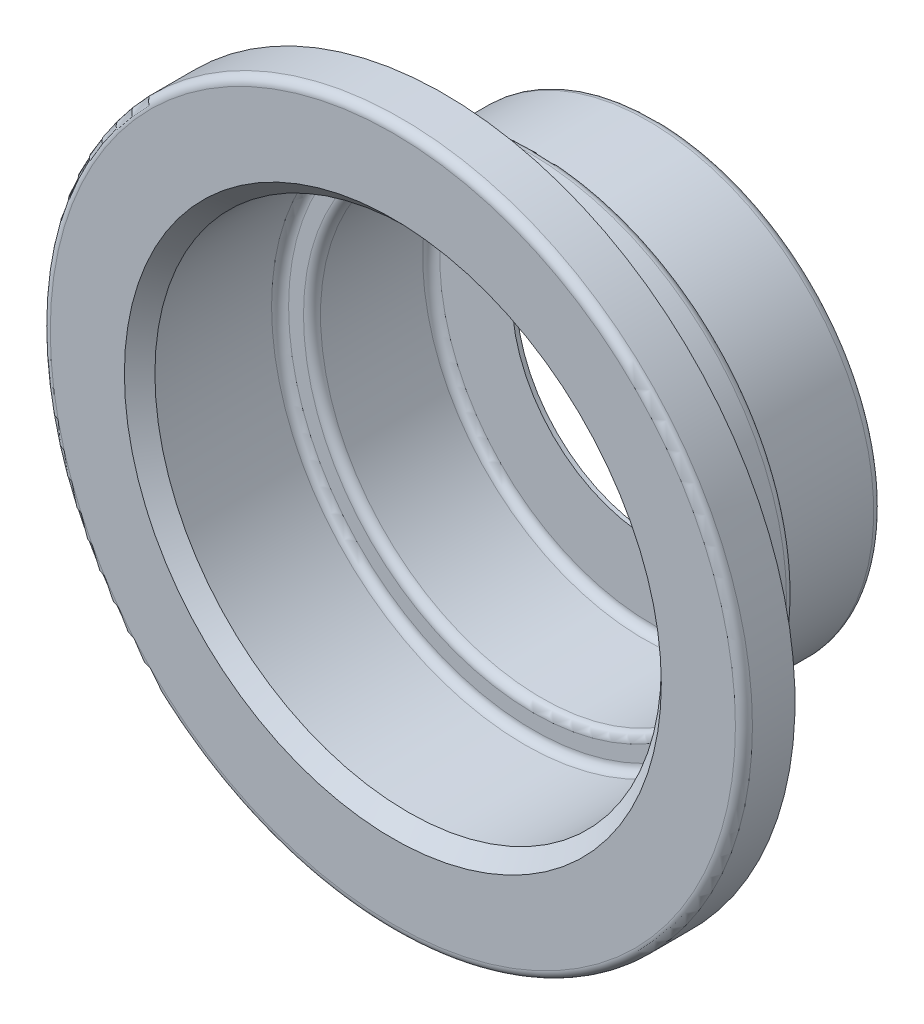
ISO-10303-21;
HEADER;
FILE_DESCRIPTION(('STEP AP214'),'2;1');
FILE_NAME('part.step','',(''),(''),'','','');
FILE_SCHEMA(('AUTOMOTIVE_DESIGN { 1 0 10303 214 1 1 1 1 }'));
ENDSEC;
DATA;
#1=APPLICATION_CONTEXT('core data for automotive mechanical design processes');
#2=APPLICATION_PROTOCOL_DEFINITION('international standard','automotive_design',2000,#1);
#3=PRODUCT_CONTEXT('',#1,'mechanical');
#4=PRODUCT('Part','Part','',(#3));
#5=PRODUCT_RELATED_PRODUCT_CATEGORY('part','',(#4));
#6=PRODUCT_DEFINITION_FORMATION('','',#4);
#7=PRODUCT_DEFINITION_CONTEXT('part definition',#1,'design');
#8=PRODUCT_DEFINITION('design','',#6,#7);
#9=PRODUCT_DEFINITION_SHAPE('','',#8);
#10=(LENGTH_UNIT() NAMED_UNIT(*) SI_UNIT(.MILLI.,.METRE.));
#11=(NAMED_UNIT(*) PLANE_ANGLE_UNIT() SI_UNIT($,.RADIAN.));
#12=(NAMED_UNIT(*) SI_UNIT($,.STERADIAN.) SOLID_ANGLE_UNIT());
#13=UNCERTAINTY_MEASURE_WITH_UNIT(LENGTH_MEASURE(1.E-05),#10,'distance_accuracy_value','');
#14=(GEOMETRIC_REPRESENTATION_CONTEXT(3) GLOBAL_UNCERTAINTY_ASSIGNED_CONTEXT((#13)) GLOBAL_UNIT_ASSIGNED_CONTEXT((#10,
#11,#12)) REPRESENTATION_CONTEXT('',''));
#15=CARTESIAN_POINT('',(0.,0.,0.));
#16=DIRECTION('',(0.,0.,1.));
#17=DIRECTION('',(1.,0.,0.));
#18=AXIS2_PLACEMENT_3D('',#15,#16,#17);
#19=CARTESIAN_POINT('',(0.,0.,0.));
#20=DIRECTION('',(0.,0.,-1.));
#21=DIRECTION('',(-1.,0.,0.));
#22=AXIS2_PLACEMENT_3D('',#19,#20,#21);
#23=PLANE('',#22);
#24=CARTESIAN_POINT('',(0.,0.,0.));
#25=DIRECTION('',(0.,0.,-1.));
#26=DIRECTION('',(-1.,0.,0.));
#27=AXIS2_PLACEMENT_3D('',#24,#25,#26);
#28=CIRCLE('',#27,12.954);
#29=CARTESIAN_POINT('',(-12.954,0.,0.));
#30=VERTEX_POINT('',#29);
#31=EDGE_CURVE('E76',#30,#30,#28,.T.);
#32=ORIENTED_EDGE('',*,*,#31,.T.);
#33=EDGE_LOOP('',(#32));
#34=FACE_BOUND('',#33,.T.);
#35=CARTESIAN_POINT('',(0.,0.,0.));
#36=DIRECTION('',(0.,0.,1.));
#37=DIRECTION('',(1.,0.,0.));
#38=AXIS2_PLACEMENT_3D('',#35,#36,#37);
#39=CIRCLE('',#38,8.382);
#40=CARTESIAN_POINT('',(8.382,0.,0.));
#41=VERTEX_POINT('',#40);
#42=EDGE_CURVE('E121',#41,#41,#39,.T.);
#43=ORIENTED_EDGE('',*,*,#42,.T.);
#44=EDGE_LOOP('',(#43));
#45=FACE_BOUND('',#44,.T.);
#46=ADVANCED_FACE('F50',(#34,#45),#23,.T.);
#47=CARTESIAN_POINT('',(0.,0.,0.));
#48=DIRECTION('',(0.,0.,-1.));
#49=DIRECTION('',(-1.,0.,0.));
#50=AXIS2_PLACEMENT_3D('',#47,#48,#49);
#51=CYLINDRICAL_SURFACE('',#50,13.462);
#52=CARTESIAN_POINT('',(0.,0.,6.604));
#53=DIRECTION('',(0.,0.,-1.));
#54=DIRECTION('',(-1.,0.,0.));
#55=AXIS2_PLACEMENT_3D('',#52,#53,#54);
#56=CIRCLE('',#55,13.462);
#57=CARTESIAN_POINT('',(-13.462,0.,6.604));
#58=VERTEX_POINT('',#57);
#59=EDGE_CURVE('E88',#58,#58,#56,.T.);
#60=ORIENTED_EDGE('',*,*,#59,.T.);
#61=EDGE_LOOP('',(#60));
#62=FACE_BOUND('',#61,.T.);
#63=CARTESIAN_POINT('',(0.,0.,0.508));
#64=DIRECTION('',(0.,0.,-1.));
#65=DIRECTION('',(-1.,0.,0.));
#66=AXIS2_PLACEMENT_3D('',#63,#64,#65);
#67=CIRCLE('',#66,13.462);
#68=CARTESIAN_POINT('',(-13.462,0.,0.508));
#69=VERTEX_POINT('',#68);
#70=EDGE_CURVE('E91',#69,#69,#67,.F.);
#71=ORIENTED_EDGE('',*,*,#70,.T.);
#72=EDGE_LOOP('',(#71));
#73=FACE_BOUND('',#72,.T.);
#74=ADVANCED_FACE('F148',(#62,#73),#51,.T.);
#75=CARTESIAN_POINT('',(0.,13.462,7.112));
#76=DIRECTION('',(0.,0.,-1.));
#77=DIRECTION('',(-1.,0.,0.));
#78=AXIS2_PLACEMENT_3D('',#75,#76,#77);
#79=PLANE('',#78);
#80=CARTESIAN_POINT('',(0.,0.,7.112));
#81=DIRECTION('',(0.,0.,-1.));
#82=DIRECTION('',(-1.,0.,0.));
#83=AXIS2_PLACEMENT_3D('',#80,#81,#82);
#84=CIRCLE('',#83,13.97);
#85=CARTESIAN_POINT('',(-13.97,0.,7.112));
#86=VERTEX_POINT('',#85);
#87=EDGE_CURVE('E82',#86,#86,#84,.F.);
#88=ORIENTED_EDGE('',*,*,#87,.T.);
#89=EDGE_LOOP('',(#88));
#90=FACE_BOUND('',#89,.T.);
#91=CARTESIAN_POINT('',(0.,0.,7.112));
#92=DIRECTION('',(0.,0.,-1.));
#93=DIRECTION('',(-1.,0.,0.));
#94=AXIS2_PLACEMENT_3D('',#91,#92,#93);
#95=CIRCLE('',#94,14.859);
#96=CARTESIAN_POINT('',(-14.859,0.,7.112));
#97=VERTEX_POINT('',#96);
#98=EDGE_CURVE('E85',#97,#97,#95,.T.);
#99=ORIENTED_EDGE('',*,*,#98,.T.);
#100=EDGE_LOOP('',(#99));
#101=FACE_BOUND('',#100,.T.);
#102=ADVANCED_FACE('F154',(#90,#101),#79,.T.);
#103=CARTESIAN_POINT('',(0.,0.,0.));
#104=DIRECTION('',(0.,0.,-1.));
#105=DIRECTION('',(-1.,0.,0.));
#106=AXIS2_PLACEMENT_3D('',#103,#104,#105);
#107=CYLINDRICAL_SURFACE('',#106,15.367);
#108=CARTESIAN_POINT('',(0.,0.,7.62));
#109=DIRECTION('',(0.,0.,-1.));
#110=DIRECTION('',(-1.,0.,0.));
#111=AXIS2_PLACEMENT_3D('',#108,#109,#110);
#112=CIRCLE('',#111,15.367);
#113=CARTESIAN_POINT('',(-15.367,0.,7.62));
#114=VERTEX_POINT('',#113);
#115=EDGE_CURVE('E79',#114,#114,#112,.F.);
#116=ORIENTED_EDGE('',*,*,#115,.T.);
#117=EDGE_LOOP('',(#116));
#118=FACE_BOUND('',#117,.T.);
#119=CARTESIAN_POINT('',(0.,0.,14.732));
#120=DIRECTION('',(0.,0.,-1.));
#121=DIRECTION('',(-1.,0.,0.));
#122=AXIS2_PLACEMENT_3D('',#119,#120,#121);
#123=CIRCLE('',#122,15.367);
#124=CARTESIAN_POINT('',(-15.367,0.,14.732));
#125=VERTEX_POINT('',#124);
#126=EDGE_CURVE('E100',#125,#125,#123,.T.);
#127=ORIENTED_EDGE('',*,*,#126,.T.);
#128=EDGE_LOOP('',(#127));
#129=FACE_BOUND('',#128,.T.);
#130=ADVANCED_FACE('F225',(#118,#129),#107,.T.);
#131=CARTESIAN_POINT('',(0.,0.,14.732));
#132=DIRECTION('',(0.,0.,1.));
#133=DIRECTION('',(1.,0.,0.));
#134=AXIS2_PLACEMENT_3D('',#131,#132,#133);
#135=CONICAL_SURFACE('',#134,15.367,0.78539816339745);
#136=CARTESIAN_POINT('',(0.,0.,15.494));
#137=DIRECTION('',(0.,0.,-1.));
#138=DIRECTION('',(-1.,0.,0.));
#139=AXIS2_PLACEMENT_3D('',#136,#137,#138);
#140=CIRCLE('',#139,16.129);
#141=CARTESIAN_POINT('',(-16.129,0.,15.494));
#142=VERTEX_POINT('',#141);
#143=EDGE_CURVE('E103',#142,#142,#140,.T.);
#144=ORIENTED_EDGE('',*,*,#143,.T.);
#145=EDGE_LOOP('',(#144));
#146=FACE_BOUND('',#145,.T.);
#147=ORIENTED_EDGE('',*,*,#126,.F.);
#148=EDGE_LOOP('',(#147));
#149=FACE_BOUND('',#148,.T.);
#150=ADVANCED_FACE('F221',(#146,#149),#135,.T.);
#151=CARTESIAN_POINT('',(0.,20.701,15.494));
#152=DIRECTION('',(0.,0.,-1.));
#153=DIRECTION('',(-1.,0.,0.));
#154=AXIS2_PLACEMENT_3D('',#151,#152,#153);
#155=PLANE('',#154);
#156=CARTESIAN_POINT('',(0.,0.,15.494));
#157=DIRECTION('',(0.,0.,-1.));
#158=DIRECTION('',(-1.,0.,0.));
#159=AXIS2_PLACEMENT_3D('',#156,#157,#158);
#160=CIRCLE('',#159,20.701);
#161=CARTESIAN_POINT('',(-20.701,0.,15.494));
#162=VERTEX_POINT('',#161);
#163=EDGE_CURVE('E106',#162,#162,#160,.T.);
#164=ORIENTED_EDGE('',*,*,#163,.T.);
#165=EDGE_LOOP('',(#164));
#166=FACE_BOUND('',#165,.T.);
#167=ORIENTED_EDGE('',*,*,#143,.F.);
#168=EDGE_LOOP('',(#167));
#169=FACE_BOUND('',#168,.T.);
#170=ADVANCED_FACE('F217',(#166,#169),#155,.T.);
#171=CARTESIAN_POINT('',(0.,0.,0.));
#172=DIRECTION('',(0.,0.,-1.));
#173=DIRECTION('',(-1.,0.,0.));
#174=AXIS2_PLACEMENT_3D('',#171,#172,#173);
#175=CYLINDRICAL_SURFACE('',#174,20.701);
#176=CARTESIAN_POINT('',(0.,0.,12.7));
#177=DIRECTION('',(0.,0.,-1.));
#178=DIRECTION('',(-1.,0.,0.));
#179=AXIS2_PLACEMENT_3D('',#176,#177,#178);
#180=CIRCLE('',#179,20.701);
#181=CARTESIAN_POINT('',(-20.701,0.,12.7));
#182=VERTEX_POINT('',#181);
#183=EDGE_CURVE('E109',#182,#182,#180,.T.);
#184=ORIENTED_EDGE('',*,*,#183,.T.);
#185=EDGE_LOOP('',(#184));
#186=FACE_BOUND('',#185,.T.);
#187=ORIENTED_EDGE('',*,*,#163,.F.);
#188=EDGE_LOOP('',(#187));
#189=FACE_BOUND('',#188,.T.);
#190=ADVANCED_FACE('F213',(#186,#189),#175,.F.);
#191=CARTESIAN_POINT('',(0.,20.955,12.7));
#192=DIRECTION('',(0.,0.,-1.));
#193=DIRECTION('',(-1.,0.,0.));
#194=AXIS2_PLACEMENT_3D('',#191,#192,#193);
#195=PLANE('',#194);
#196=CARTESIAN_POINT('',(0.,0.,12.7));
#197=DIRECTION('',(0.,0.,-1.));
#198=DIRECTION('',(-1.,0.,0.));
#199=AXIS2_PLACEMENT_3D('',#196,#197,#198);
#200=CIRCLE('',#199,20.955);
#201=CARTESIAN_POINT('',(-20.955,0.,12.7));
#202=VERTEX_POINT('',#201);
#203=EDGE_CURVE('E112',#202,#202,#200,.T.);
#204=ORIENTED_EDGE('',*,*,#203,.T.);
#205=EDGE_LOOP('',(#204));
#206=FACE_BOUND('',#205,.T.);
#207=ORIENTED_EDGE('',*,*,#183,.F.);
#208=EDGE_LOOP('',(#207));
#209=FACE_BOUND('',#208,.T.);
#210=ADVANCED_FACE('F207',(#206,#209),#195,.T.);
#211=CARTESIAN_POINT('',(0.,0.,0.));
#212=DIRECTION('',(0.,0.,-1.));
#213=DIRECTION('',(-1.,0.,0.));
#214=AXIS2_PLACEMENT_3D('',#211,#212,#213);
#215=CYLINDRICAL_SURFACE('',#214,20.955);
#216=CARTESIAN_POINT('',(0.,0.,15.24));
#217=DIRECTION('',(0.,0.,1.));
#218=DIRECTION('',(1.,0.,0.));
#219=AXIS2_PLACEMENT_3D('',#216,#217,#218);
#220=CIRCLE('',#219,20.955);
#221=CARTESIAN_POINT('',(20.955,0.,15.24));
#222=VERTEX_POINT('',#221);
#223=EDGE_CURVE('E97',#222,#222,#220,.F.);
#224=ORIENTED_EDGE('',*,*,#223,.T.);
#225=EDGE_LOOP('',(#224));
#226=FACE_BOUND('',#225,.T.);
#227=ORIENTED_EDGE('',*,*,#203,.F.);
#228=EDGE_LOOP('',(#227));
#229=FACE_BOUND('',#228,.T.);
#230=ADVANCED_FACE('F201',(#226,#229),#215,.T.);
#231=CARTESIAN_POINT('',(0.,16.7422102448428,15.748));
#232=DIRECTION('',(0.,0.,1.));
#233=DIRECTION('',(1.,0.,0.));
#234=AXIS2_PLACEMENT_3D('',#231,#232,#233);
#235=PLANE('',#234);
#236=CARTESIAN_POINT('',(0.,0.,15.748));
#237=DIRECTION('',(0.,0.,1.));
#238=DIRECTION('',(1.,0.,0.));
#239=AXIS2_PLACEMENT_3D('',#236,#237,#238);
#240=CIRCLE('',#239,20.447);
#241=CARTESIAN_POINT('',(20.447,0.,15.748));
#242=VERTEX_POINT('',#241);
#243=EDGE_CURVE('E94',#242,#242,#240,.T.);
#244=ORIENTED_EDGE('',*,*,#243,.T.);
#245=EDGE_LOOP('',(#244));
#246=FACE_BOUND('',#245,.T.);
#247=CARTESIAN_POINT('',(0.,0.,15.748));
#248=DIRECTION('',(0.,0.,-1.));
#249=DIRECTION('',(-1.,0.,0.));
#250=AXIS2_PLACEMENT_3D('',#247,#248,#249);
#251=CIRCLE('',#250,16.0237897551573);
#252=CARTESIAN_POINT('',(-16.0237897551573,0.,15.748));
#253=VERTEX_POINT('',#252);
#254=EDGE_CURVE('E115',#253,#253,#251,.T.);
#255=ORIENTED_EDGE('',*,*,#254,.T.);
#256=EDGE_LOOP('',(#255));
#257=FACE_BOUND('',#256,.T.);
#258=ADVANCED_FACE('F196',(#246,#257),#235,.T.);
#259=CARTESIAN_POINT('',(0.,0.,15.748));
#260=DIRECTION('',(0.,0.,1.));
#261=DIRECTION('',(1.,0.,0.));
#262=AXIS2_PLACEMENT_3D('',#259,#260,#261);
#263=CONICAL_SURFACE('',#262,16.0237897551573,0.785398163397451);
#264=CARTESIAN_POINT('',(0.,0.,14.8372102448428));
#265=DIRECTION('',(0.,0.,-1.));
#266=DIRECTION('',(-1.,0.,0.));
#267=AXIS2_PLACEMENT_3D('',#264,#265,#266);
#268=CIRCLE('',#267,15.113);
#269=CARTESIAN_POINT('',(-15.113,0.,14.8372102448428));
#270=VERTEX_POINT('',#269);
#271=EDGE_CURVE('E118',#270,#270,#268,.T.);
#272=ORIENTED_EDGE('',*,*,#271,.T.);
#273=EDGE_LOOP('',(#272));
#274=FACE_BOUND('',#273,.T.);
#275=ORIENTED_EDGE('',*,*,#254,.F.);
#276=EDGE_LOOP('',(#275));
#277=FACE_BOUND('',#276,.T.);
#278=ADVANCED_FACE('F190',(#274,#277),#263,.F.);
#279=CARTESIAN_POINT('',(0.,0.,0.));
#280=DIRECTION('',(0.,0.,-1.));
#281=DIRECTION('',(-1.,0.,0.));
#282=AXIS2_PLACEMENT_3D('',#279,#280,#281);
#283=CYLINDRICAL_SURFACE('',#282,15.113);
#284=CARTESIAN_POINT('',(0.,0.,7.874));
#285=DIRECTION('',(0.,0.,1.));
#286=DIRECTION('',(1.,0.,0.));
#287=AXIS2_PLACEMENT_3D('',#284,#285,#286);
#288=CIRCLE('',#287,15.113);
#289=CARTESIAN_POINT('',(15.113,0.,7.874));
#290=VERTEX_POINT('',#289);
#291=EDGE_CURVE('E61',#290,#290,#288,.F.);
#292=ORIENTED_EDGE('',*,*,#291,.T.);
#293=EDGE_LOOP('',(#292));
#294=FACE_BOUND('',#293,.T.);
#295=ORIENTED_EDGE('',*,*,#271,.F.);
#296=EDGE_LOOP('',(#295));
#297=FACE_BOUND('',#296,.T.);
#298=ADVANCED_FACE('F187',(#294,#297),#283,.F.);
#299=CARTESIAN_POINT('',(0.,15.113,7.366));
#300=DIRECTION('',(0.,0.,1.));
#301=DIRECTION('',(1.,0.,0.));
#302=AXIS2_PLACEMENT_3D('',#299,#300,#301);
#303=PLANE('',#302);
#304=CARTESIAN_POINT('',(0.,0.,7.366));
#305=DIRECTION('',(0.,0.,1.));
#306=DIRECTION('',(1.,0.,0.));
#307=AXIS2_PLACEMENT_3D('',#304,#305,#306);
#308=CIRCLE('',#307,14.605);
#309=CARTESIAN_POINT('',(14.605,0.,7.366));
#310=VERTEX_POINT('',#309);
#311=EDGE_CURVE('E12',#310,#310,#308,.T.);
#312=ORIENTED_EDGE('',*,*,#311,.T.);
#313=EDGE_LOOP('',(#312));
#314=FACE_BOUND('',#313,.T.);
#315=CARTESIAN_POINT('',(0.,0.,7.366));
#316=DIRECTION('',(0.,0.,1.));
#317=DIRECTION('',(1.,0.,0.));
#318=AXIS2_PLACEMENT_3D('',#315,#316,#317);
#319=CIRCLE('',#318,13.716);
#320=CARTESIAN_POINT('',(13.716,0.,7.366));
#321=VERTEX_POINT('',#320);
#322=EDGE_CURVE('E57',#321,#321,#319,.F.);
#323=ORIENTED_EDGE('',*,*,#322,.T.);
#324=EDGE_LOOP('',(#323));
#325=FACE_BOUND('',#324,.T.);
#326=ADVANCED_FACE('F144',(#314,#325),#303,.T.);
#327=CARTESIAN_POINT('',(0.,0.,0.));
#328=DIRECTION('',(0.,0.,-1.));
#329=DIRECTION('',(-1.,0.,0.));
#330=AXIS2_PLACEMENT_3D('',#327,#328,#329);
#331=CYLINDRICAL_SURFACE('',#330,13.208);
#332=CARTESIAN_POINT('',(0.,0.,0.762));
#333=DIRECTION('',(0.,0.,1.));
#334=DIRECTION('',(1.,0.,0.));
#335=AXIS2_PLACEMENT_3D('',#332,#333,#334);
#336=CIRCLE('',#335,13.208);
#337=CARTESIAN_POINT('',(13.208,0.,0.762));
#338=VERTEX_POINT('',#337);
#339=EDGE_CURVE('E70',#338,#338,#336,.F.);
#340=ORIENTED_EDGE('',*,*,#339,.T.);
#341=EDGE_LOOP('',(#340));
#342=FACE_BOUND('',#341,.T.);
#343=CARTESIAN_POINT('',(0.,0.,6.858));
#344=DIRECTION('',(0.,0.,1.));
#345=DIRECTION('',(1.,0.,0.));
#346=AXIS2_PLACEMENT_3D('',#343,#344,#345);
#347=CIRCLE('',#346,13.208);
#348=CARTESIAN_POINT('',(13.208,0.,6.858));
#349=VERTEX_POINT('',#348);
#350=EDGE_CURVE('E73',#349,#349,#347,.T.);
#351=ORIENTED_EDGE('',*,*,#350,.T.);
#352=EDGE_LOOP('',(#351));
#353=FACE_BOUND('',#352,.T.);
#354=ADVANCED_FACE('F138',(#342,#353),#331,.F.);
#355=CARTESIAN_POINT('',(0.,13.208,0.254));
#356=DIRECTION('',(0.,0.,1.));
#357=DIRECTION('',(1.,0.,0.));
#358=AXIS2_PLACEMENT_3D('',#355,#356,#357);
#359=PLANE('',#358);
#360=CARTESIAN_POINT('',(0.,0.,0.254));
#361=DIRECTION('',(0.,0.,1.));
#362=DIRECTION('',(1.,0.,0.));
#363=AXIS2_PLACEMENT_3D('',#360,#361,#362);
#364=CIRCLE('',#363,12.7);
#365=CARTESIAN_POINT('',(12.7,0.,0.254));
#366=VERTEX_POINT('',#365);
#367=EDGE_CURVE('E65',#366,#366,#364,.T.);
#368=ORIENTED_EDGE('',*,*,#367,.T.);
#369=EDGE_LOOP('',(#368));
#370=FACE_BOUND('',#369,.T.);
#371=CARTESIAN_POINT('',(0.,0.,0.254));
#372=DIRECTION('',(0.,0.,1.));
#373=DIRECTION('',(1.,0.,0.));
#374=AXIS2_PLACEMENT_3D('',#371,#372,#373);
#375=CIRCLE('',#374,8.382);
#376=CARTESIAN_POINT('',(8.382,0.,0.254));
#377=VERTEX_POINT('',#376);
#378=EDGE_CURVE('E122',#377,#377,#375,.T.);
#379=ORIENTED_EDGE('',*,*,#378,.F.);
#380=EDGE_LOOP('',(#379));
#381=FACE_BOUND('',#380,.T.);
#382=ADVANCED_FACE('F133',(#370,#381),#359,.T.);
#383=CARTESIAN_POINT('',(0.,0.,0.));
#384=DIRECTION('',(0.,0.,1.));
#385=DIRECTION('',(1.,0.,0.));
#386=AXIS2_PLACEMENT_3D('',#383,#384,#385);
#387=CYLINDRICAL_SURFACE('',#386,8.382);
#388=ORIENTED_EDGE('',*,*,#42,.F.);
#389=EDGE_LOOP('',(#388));
#390=FACE_BOUND('',#389,.T.);
#391=ORIENTED_EDGE('',*,*,#378,.T.);
#392=EDGE_LOOP('',(#391));
#393=FACE_BOUND('',#392,.T.);
#394=ADVANCED_FACE('F129',(#390,#393),#387,.F.);
#395=CARTESIAN_POINT('',(0.,0.,15.24));
#396=DIRECTION('',(0.,0.,1.));
#397=DIRECTION('',(1.,0.,0.));
#398=AXIS2_PLACEMENT_3D('',#395,#396,#397);
#399=TOROIDAL_SURFACE('',#398,20.447,0.508);
#400=ORIENTED_EDGE('',*,*,#243,.F.);
#401=EDGE_LOOP('',(#400));
#402=FACE_BOUND('',#401,.T.);
#403=ORIENTED_EDGE('',*,*,#223,.F.);
#404=EDGE_LOOP('',(#403));
#405=FACE_BOUND('',#404,.T.);
#406=ADVANCED_FACE('F132',(#402,#405),#399,.T.);
#407=CARTESIAN_POINT('',(0.,0.,6.604));
#408=DIRECTION('',(0.,0.,-1.));
#409=DIRECTION('',(-1.,0.,0.));
#410=AXIS2_PLACEMENT_3D('',#407,#408,#409);
#411=TOROIDAL_SURFACE('',#410,13.97,0.508);
#412=ORIENTED_EDGE('',*,*,#87,.F.);
#413=EDGE_LOOP('',(#412));
#414=FACE_BOUND('',#413,.T.);
#415=ORIENTED_EDGE('',*,*,#59,.F.);
#416=EDGE_LOOP('',(#415));
#417=FACE_BOUND('',#416,.T.);
#418=ADVANCED_FACE('F161',(#414,#417),#411,.F.);
#419=CARTESIAN_POINT('',(0.,0.,7.62));
#420=DIRECTION('',(0.,0.,-1.));
#421=DIRECTION('',(-1.,0.,0.));
#422=AXIS2_PLACEMENT_3D('',#419,#420,#421);
#423=TOROIDAL_SURFACE('',#422,14.859,0.508);
#424=ORIENTED_EDGE('',*,*,#115,.F.);
#425=EDGE_LOOP('',(#424));
#426=FACE_BOUND('',#425,.T.);
#427=ORIENTED_EDGE('',*,*,#98,.F.);
#428=EDGE_LOOP('',(#427));
#429=FACE_BOUND('',#428,.T.);
#430=ADVANCED_FACE('F165',(#426,#429),#423,.T.);
#431=CARTESIAN_POINT('',(0.,0.,0.508));
#432=DIRECTION('',(0.,0.,-1.));
#433=DIRECTION('',(-1.,0.,0.));
#434=AXIS2_PLACEMENT_3D('',#431,#432,#433);
#435=TOROIDAL_SURFACE('',#434,12.954,0.508);
#436=ORIENTED_EDGE('',*,*,#70,.F.);
#437=EDGE_LOOP('',(#436));
#438=FACE_BOUND('',#437,.T.);
#439=ORIENTED_EDGE('',*,*,#31,.F.);
#440=EDGE_LOOP('',(#439));
#441=FACE_BOUND('',#440,.T.);
#442=ADVANCED_FACE('F169',(#438,#441),#435,.T.);
#443=CARTESIAN_POINT('',(0.,0.,0.762));
#444=DIRECTION('',(0.,0.,1.));
#445=DIRECTION('',(1.,0.,0.));
#446=AXIS2_PLACEMENT_3D('',#443,#444,#445);
#447=TOROIDAL_SURFACE('',#446,12.7,0.508);
#448=ORIENTED_EDGE('',*,*,#367,.F.);
#449=EDGE_LOOP('',(#448));
#450=FACE_BOUND('',#449,.T.);
#451=ORIENTED_EDGE('',*,*,#339,.F.);
#452=EDGE_LOOP('',(#451));
#453=FACE_BOUND('',#452,.T.);
#454=ADVANCED_FACE('F173',(#450,#453),#447,.F.);
#455=CARTESIAN_POINT('',(0.,0.,7.874));
#456=DIRECTION('',(0.,0.,1.));
#457=DIRECTION('',(1.,0.,0.));
#458=AXIS2_PLACEMENT_3D('',#455,#456,#457);
#459=TOROIDAL_SURFACE('',#458,14.605,0.508);
#460=ORIENTED_EDGE('',*,*,#311,.F.);
#461=EDGE_LOOP('',(#460));
#462=FACE_BOUND('',#461,.T.);
#463=ORIENTED_EDGE('',*,*,#291,.F.);
#464=EDGE_LOOP('',(#463));
#465=FACE_BOUND('',#464,.T.);
#466=ADVANCED_FACE('F176',(#462,#465),#459,.F.);
#467=CARTESIAN_POINT('',(0.,0.,6.858));
#468=DIRECTION('',(0.,0.,1.));
#469=DIRECTION('',(1.,0.,0.));
#470=AXIS2_PLACEMENT_3D('',#467,#468,#469);
#471=TOROIDAL_SURFACE('',#470,13.716,0.508);
#472=ORIENTED_EDGE('',*,*,#350,.F.);
#473=EDGE_LOOP('',(#472));
#474=FACE_BOUND('',#473,.T.);
#475=ORIENTED_EDGE('',*,*,#322,.F.);
#476=EDGE_LOOP('',(#475));
#477=FACE_BOUND('',#476,.T.);
#478=ADVANCED_FACE('F52',(#474,#477),#471,.T.);
#479=CLOSED_SHELL('',(#46,#74,#102,#130,#150,#170,#190,#210,#230,#258,#278,#298,#326,#354,#382,
#394,#406,#418,#430,#442,#454,#466,#478));
#480=MANIFOLD_SOLID_BREP('B2',#479);
#481=ADVANCED_BREP_SHAPE_REPRESENTATION('',(#18,#480),#14);
#482=SHAPE_DEFINITION_REPRESENTATION(#9,#481);
ENDSEC;
END-ISO-10303-21;
